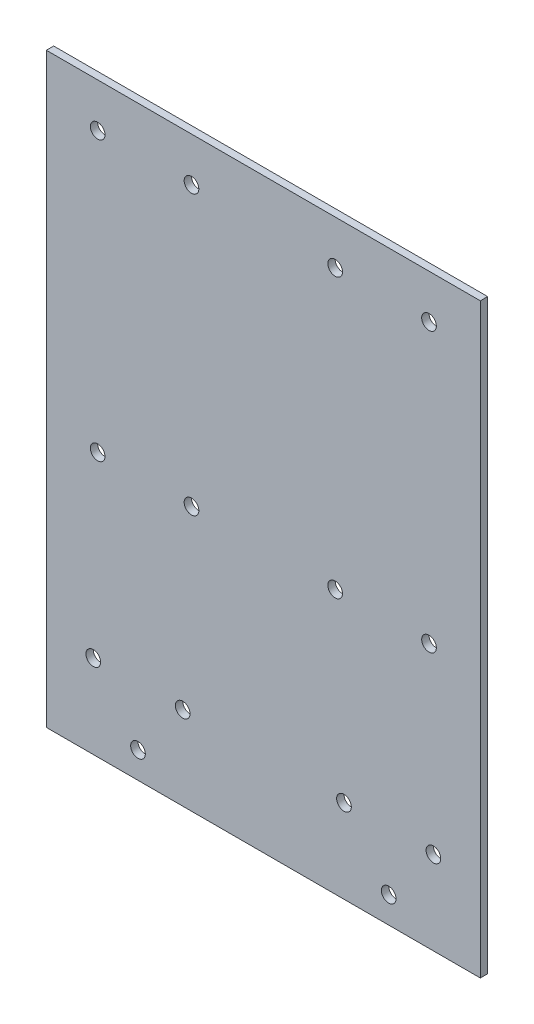
ISO-10303-21;
HEADER;
FILE_DESCRIPTION(('STEP AP214'),'2;1');
FILE_NAME('part.step','',(''),(''),'','','');
FILE_SCHEMA(('AUTOMOTIVE_DESIGN { 1 0 10303 214 1 1 1 1 }'));
ENDSEC;
DATA;
#1=APPLICATION_CONTEXT('core data for automotive mechanical design processes');
#2=APPLICATION_PROTOCOL_DEFINITION('international standard','automotive_design',2000,#1);
#3=PRODUCT_CONTEXT('',#1,'mechanical');
#4=PRODUCT('Part','Part','',(#3));
#5=PRODUCT_RELATED_PRODUCT_CATEGORY('part','',(#4));
#6=PRODUCT_DEFINITION_FORMATION('','',#4);
#7=PRODUCT_DEFINITION_CONTEXT('part definition',#1,'design');
#8=PRODUCT_DEFINITION('design','',#6,#7);
#9=PRODUCT_DEFINITION_SHAPE('','',#8);
#10=(LENGTH_UNIT() NAMED_UNIT(*) SI_UNIT(.MILLI.,.METRE.));
#11=(NAMED_UNIT(*) PLANE_ANGLE_UNIT() SI_UNIT($,.RADIAN.));
#12=(NAMED_UNIT(*) SI_UNIT($,.STERADIAN.) SOLID_ANGLE_UNIT());
#13=UNCERTAINTY_MEASURE_WITH_UNIT(LENGTH_MEASURE(1.E-05),#10,'distance_accuracy_value','');
#14=(GEOMETRIC_REPRESENTATION_CONTEXT(3) GLOBAL_UNCERTAINTY_ASSIGNED_CONTEXT((#13)) GLOBAL_UNIT_ASSIGNED_CONTEXT((#10,
#11,#12)) REPRESENTATION_CONTEXT('',''));
#15=CARTESIAN_POINT('',(0.,0.,0.));
#16=DIRECTION('',(0.,0.,1.));
#17=DIRECTION('',(1.,0.,0.));
#18=AXIS2_PLACEMENT_3D('',#15,#16,#17);
#19=CARTESIAN_POINT('',(0.,0.,2.5));
#20=DIRECTION('',(0.,0.,1.));
#21=DIRECTION('',(1.,0.,0.));
#22=AXIS2_PLACEMENT_3D('',#19,#20,#21);
#23=PLANE('',#22);
#24=CARTESIAN_POINT('',(24.4999999999997,85.,2.5));
#25=DIRECTION('',(0.,0.,1.));
#26=DIRECTION('',(-1.,0.,0.));
#27=AXIS2_PLACEMENT_3D('',#24,#25,#26);
#28=CIRCLE('',#27,2.5);
#29=CARTESIAN_POINT('',(21.9999999999997,85.,2.5));
#30=VERTEX_POINT('',#29);
#31=EDGE_CURVE('E395',#30,#30,#28,.T.);
#32=ORIENTED_EDGE('',*,*,#31,.F.);
#33=EDGE_LOOP('',(#32));
#34=FACE_BOUND('',#33,.T.);
#35=CARTESIAN_POINT('',(-24.5000000000003,85.,2.5));
#36=DIRECTION('',(0.,0.,1.));
#37=DIRECTION('',(1.,0.,0.));
#38=AXIS2_PLACEMENT_3D('',#35,#36,#37);
#39=CIRCLE('',#38,2.5);
#40=CARTESIAN_POINT('',(-22.0000000000003,85.,2.5));
#41=VERTEX_POINT('',#40);
#42=EDGE_CURVE('E396',#41,#41,#39,.T.);
#43=ORIENTED_EDGE('',*,*,#42,.F.);
#44=EDGE_LOOP('',(#43));
#45=FACE_BOUND('',#44,.T.);
#46=CARTESIAN_POINT('',(-56.5000000000003,85.,2.5));
#47=DIRECTION('',(0.,0.,1.));
#48=DIRECTION('',(1.,0.,0.));
#49=AXIS2_PLACEMENT_3D('',#46,#47,#48);
#50=CIRCLE('',#49,2.50000000000001);
#51=CARTESIAN_POINT('',(-54.0000000000003,85.,2.5));
#52=VERTEX_POINT('',#51);
#53=EDGE_CURVE('E400',#52,#52,#50,.T.);
#54=ORIENTED_EDGE('',*,*,#53,.F.);
#55=EDGE_LOOP('',(#54));
#56=FACE_BOUND('',#55,.T.);
#57=CARTESIAN_POINT('',(-24.5,-9.99999999999998,2.5));
#58=DIRECTION('',(0.,0.,1.));
#59=DIRECTION('',(1.,0.,0.));
#60=AXIS2_PLACEMENT_3D('',#57,#58,#59);
#61=CIRCLE('',#60,2.5);
#62=CARTESIAN_POINT('',(-22.,-9.99999999999998,2.5));
#63=VERTEX_POINT('',#62);
#64=EDGE_CURVE('E407',#63,#63,#61,.T.);
#65=ORIENTED_EDGE('',*,*,#64,.F.);
#66=EDGE_LOOP('',(#65));
#67=FACE_BOUND('',#66,.T.);
#68=CARTESIAN_POINT('',(56.4999999999994,-9.99999999999997,2.5));
#69=DIRECTION('',(0.,0.,1.));
#70=DIRECTION('',(-1.,0.,0.));
#71=AXIS2_PLACEMENT_3D('',#68,#69,#70);
#72=CIRCLE('',#71,2.49999999999999);
#73=CARTESIAN_POINT('',(53.9999999999994,-9.99999999999997,2.5));
#74=VERTEX_POINT('',#73);
#75=EDGE_CURVE('E426',#74,#74,#72,.T.);
#76=ORIENTED_EDGE('',*,*,#75,.F.);
#77=EDGE_LOOP('',(#76));
#78=FACE_BOUND('',#77,.T.);
#79=CARTESIAN_POINT('',(24.4999999999993,-9.99999999999997,2.5));
#80=DIRECTION('',(0.,0.,1.));
#81=DIRECTION('',(-1.,0.,0.));
#82=AXIS2_PLACEMENT_3D('',#79,#80,#81);
#83=CIRCLE('',#82,2.5);
#84=CARTESIAN_POINT('',(21.9999999999993,-9.99999999999997,2.5));
#85=VERTEX_POINT('',#84);
#86=EDGE_CURVE('E403',#85,#85,#83,.T.);
#87=ORIENTED_EDGE('',*,*,#86,.F.);
#88=EDGE_LOOP('',(#87));
#89=FACE_BOUND('',#88,.T.);
#90=CARTESIAN_POINT('',(56.4999999999997,85.,2.5));
#91=DIRECTION('',(0.,0.,1.));
#92=DIRECTION('',(-1.,0.,0.));
#93=AXIS2_PLACEMENT_3D('',#90,#91,#92);
#94=CIRCLE('',#93,2.50000000000001);
#95=CARTESIAN_POINT('',(53.9999999999996,85.,2.5));
#96=VERTEX_POINT('',#95);
#97=EDGE_CURVE('E397',#96,#96,#94,.T.);
#98=ORIENTED_EDGE('',*,*,#97,.F.);
#99=EDGE_LOOP('',(#98));
#100=FACE_BOUND('',#99,.T.);
#101=CARTESIAN_POINT('',(-56.5,-9.99999999999998,2.5));
#102=DIRECTION('',(0.,0.,1.));
#103=DIRECTION('',(1.,0.,0.));
#104=AXIS2_PLACEMENT_3D('',#101,#102,#103);
#105=CIRCLE('',#104,2.49999999999999);
#106=CARTESIAN_POINT('',(-54.,-9.99999999999998,2.5));
#107=VERTEX_POINT('',#106);
#108=EDGE_CURVE('E117',#107,#107,#105,.T.);
#109=ORIENTED_EDGE('',*,*,#108,.F.);
#110=EDGE_LOOP('',(#109));
#111=FACE_BOUND('',#110,.T.);
#112=CARTESIAN_POINT('',(58.,-71.5,2.5));
#113=DIRECTION('',(0.,0.,1.));
#114=DIRECTION('',(-1.,0.,0.));
#115=AXIS2_PLACEMENT_3D('',#112,#113,#114);
#116=CIRCLE('',#115,2.50000000000001);
#117=CARTESIAN_POINT('',(55.5,-71.5,2.5));
#118=VERTEX_POINT('',#117);
#119=EDGE_CURVE('E149',#118,#118,#116,.T.);
#120=ORIENTED_EDGE('',*,*,#119,.F.);
#121=EDGE_LOOP('',(#120));
#122=FACE_BOUND('',#121,.T.);
#123=CARTESIAN_POINT('',(-42.75,-91.,2.5));
#124=DIRECTION('',(0.,0.,1.));
#125=DIRECTION('',(1.,0.,0.));
#126=AXIS2_PLACEMENT_3D('',#123,#124,#125);
#127=CIRCLE('',#126,2.5);
#128=CARTESIAN_POINT('',(-40.25,-91.,2.5));
#129=VERTEX_POINT('',#128);
#130=EDGE_CURVE('E161',#129,#129,#127,.T.);
#131=ORIENTED_EDGE('',*,*,#130,.F.);
#132=EDGE_LOOP('',(#131));
#133=FACE_BOUND('',#132,.T.);
#134=CARTESIAN_POINT('',(-58.,-71.5,2.5));
#135=DIRECTION('',(0.,0.,1.));
#136=DIRECTION('',(1.,0.,0.));
#137=AXIS2_PLACEMENT_3D('',#134,#135,#136);
#138=CIRCLE('',#137,2.50000000000001);
#139=CARTESIAN_POINT('',(-55.5,-71.5,2.5));
#140=VERTEX_POINT('',#139);
#141=EDGE_CURVE('E107',#140,#140,#138,.T.);
#142=ORIENTED_EDGE('',*,*,#141,.F.);
#143=EDGE_LOOP('',(#142));
#144=FACE_BOUND('',#143,.T.);
#145=DIRECTION('',(0.,-1.,0.));
#146=VECTOR('',#145,1.);
#147=CARTESIAN_POINT('',(-74.,-100.,2.5));
#148=LINE('',#147,#146);
#149=CARTESIAN_POINT('',(-74.,100.,2.5));
#150=VERTEX_POINT('',#149);
#151=CARTESIAN_POINT('',(-74.,-100.,2.5));
#152=VERTEX_POINT('',#151);
#153=EDGE_CURVE('E91',#150,#152,#148,.T.);
#154=ORIENTED_EDGE('',*,*,#153,.T.);
#155=DIRECTION('',(1.,0.,0.));
#156=VECTOR('',#155,1.);
#157=CARTESIAN_POINT('',(74.,-100.,2.5));
#158=LINE('',#157,#156);
#159=CARTESIAN_POINT('',(74.,-100.,2.5));
#160=VERTEX_POINT('',#159);
#161=EDGE_CURVE('E86',#152,#160,#158,.T.);
#162=ORIENTED_EDGE('',*,*,#161,.T.);
#163=DIRECTION('',(0.,1.,0.));
#164=VECTOR('',#163,1.);
#165=CARTESIAN_POINT('',(74.,-100.,2.5));
#166=LINE('',#165,#164);
#167=CARTESIAN_POINT('',(74.,100.,2.5));
#168=VERTEX_POINT('',#167);
#169=EDGE_CURVE('E89',#160,#168,#166,.T.);
#170=ORIENTED_EDGE('',*,*,#169,.T.);
#171=DIRECTION('',(-1.,0.,0.));
#172=VECTOR('',#171,1.);
#173=CARTESIAN_POINT('',(74.,100.,2.5));
#174=LINE('',#173,#172);
#175=EDGE_CURVE('E56',#168,#150,#174,.T.);
#176=ORIENTED_EDGE('',*,*,#175,.T.);
#177=EDGE_LOOP('',(#154,#162,#170,#176));
#178=FACE_BOUND('',#177,.T.);
#179=CARTESIAN_POINT('',(-27.5,-71.5,2.5));
#180=DIRECTION('',(0.,0.,1.));
#181=DIRECTION('',(1.,0.,0.));
#182=AXIS2_PLACEMENT_3D('',#179,#180,#181);
#183=CIRCLE('',#182,2.5);
#184=CARTESIAN_POINT('',(-25.,-71.5,2.5));
#185=VERTEX_POINT('',#184);
#186=EDGE_CURVE('E167',#185,#185,#183,.T.);
#187=ORIENTED_EDGE('',*,*,#186,.F.);
#188=EDGE_LOOP('',(#187));
#189=FACE_BOUND('',#188,.T.);
#190=CARTESIAN_POINT('',(42.75,-91.,2.5));
#191=DIRECTION('',(0.,0.,1.));
#192=DIRECTION('',(-1.,0.,0.));
#193=AXIS2_PLACEMENT_3D('',#190,#191,#192);
#194=CIRCLE('',#193,2.5);
#195=CARTESIAN_POINT('',(40.25,-91.,2.5));
#196=VERTEX_POINT('',#195);
#197=EDGE_CURVE('E155',#196,#196,#194,.T.);
#198=ORIENTED_EDGE('',*,*,#197,.F.);
#199=EDGE_LOOP('',(#198));
#200=FACE_BOUND('',#199,.T.);
#201=CARTESIAN_POINT('',(27.5,-71.5,2.5));
#202=DIRECTION('',(0.,0.,1.));
#203=DIRECTION('',(-1.,0.,0.));
#204=AXIS2_PLACEMENT_3D('',#201,#202,#203);
#205=CIRCLE('',#204,2.5);
#206=CARTESIAN_POINT('',(25.,-71.5,2.5));
#207=VERTEX_POINT('',#206);
#208=EDGE_CURVE('E140',#207,#207,#205,.T.);
#209=ORIENTED_EDGE('',*,*,#208,.F.);
#210=EDGE_LOOP('',(#209));
#211=FACE_BOUND('',#210,.T.);
#212=ADVANCED_FACE('F37',(#34,#45,#56,#67,#78,#89,#100,#111,#122,#133,#144,#178,#189,#200,#211),
#23,.T.);
#213=CARTESIAN_POINT('',(0.,0.,0.));
#214=DIRECTION('',(0.,0.,1.));
#215=DIRECTION('',(1.,0.,0.));
#216=AXIS2_PLACEMENT_3D('',#213,#214,#215);
#217=PLANE('',#216);
#218=CARTESIAN_POINT('',(24.4999999999997,85.,0.));
#219=DIRECTION('',(0.,0.,1.));
#220=DIRECTION('',(1.,0.,0.));
#221=AXIS2_PLACEMENT_3D('',#218,#219,#220);
#222=CIRCLE('',#221,2.5);
#223=CARTESIAN_POINT('',(26.9999999999997,85.,0.));
#224=VERTEX_POINT('',#223);
#225=EDGE_CURVE('E41',#224,#224,#222,.T.);
#226=ORIENTED_EDGE('',*,*,#225,.T.);
#227=EDGE_LOOP('',(#226));
#228=FACE_BOUND('',#227,.T.);
#229=CARTESIAN_POINT('',(-24.5000000000003,85.,0.));
#230=DIRECTION('',(0.,0.,1.));
#231=DIRECTION('',(1.,0.,0.));
#232=AXIS2_PLACEMENT_3D('',#229,#230,#231);
#233=CIRCLE('',#232,2.5);
#234=CARTESIAN_POINT('',(-22.0000000000003,85.,0.));
#235=VERTEX_POINT('',#234);
#236=EDGE_CURVE('E131',#235,#235,#233,.T.);
#237=ORIENTED_EDGE('',*,*,#236,.T.);
#238=EDGE_LOOP('',(#237));
#239=FACE_BOUND('',#238,.T.);
#240=CARTESIAN_POINT('',(-56.5000000000003,85.,0.));
#241=DIRECTION('',(0.,0.,1.));
#242=DIRECTION('',(1.,0.,0.));
#243=AXIS2_PLACEMENT_3D('',#240,#241,#242);
#244=CIRCLE('',#243,2.50000000000001);
#245=CARTESIAN_POINT('',(-54.0000000000003,85.,0.));
#246=VERTEX_POINT('',#245);
#247=EDGE_CURVE('E129',#246,#246,#244,.T.);
#248=ORIENTED_EDGE('',*,*,#247,.T.);
#249=EDGE_LOOP('',(#248));
#250=FACE_BOUND('',#249,.T.);
#251=CARTESIAN_POINT('',(-24.5,-9.99999999999998,0.));
#252=DIRECTION('',(0.,0.,1.));
#253=DIRECTION('',(1.,0.,0.));
#254=AXIS2_PLACEMENT_3D('',#251,#252,#253);
#255=CIRCLE('',#254,2.5);
#256=CARTESIAN_POINT('',(-22.,-9.99999999999998,0.));
#257=VERTEX_POINT('',#256);
#258=EDGE_CURVE('E126',#257,#257,#255,.T.);
#259=ORIENTED_EDGE('',*,*,#258,.T.);
#260=EDGE_LOOP('',(#259));
#261=FACE_BOUND('',#260,.T.);
#262=CARTESIAN_POINT('',(56.4999999999994,-9.99999999999997,0.));
#263=DIRECTION('',(0.,0.,1.));
#264=DIRECTION('',(1.,0.,0.));
#265=AXIS2_PLACEMENT_3D('',#262,#263,#264);
#266=CIRCLE('',#265,2.49999999999999);
#267=CARTESIAN_POINT('',(58.9999999999994,-9.99999999999997,0.));
#268=VERTEX_POINT('',#267);
#269=EDGE_CURVE('E123',#268,#268,#266,.T.);
#270=ORIENTED_EDGE('',*,*,#269,.T.);
#271=EDGE_LOOP('',(#270));
#272=FACE_BOUND('',#271,.T.);
#273=CARTESIAN_POINT('',(24.4999999999993,-9.99999999999997,0.));
#274=DIRECTION('',(0.,0.,1.));
#275=DIRECTION('',(1.,0.,0.));
#276=AXIS2_PLACEMENT_3D('',#273,#274,#275);
#277=CIRCLE('',#276,2.5);
#278=CARTESIAN_POINT('',(26.9999999999993,-9.99999999999997,0.));
#279=VERTEX_POINT('',#278);
#280=EDGE_CURVE('E120',#279,#279,#277,.T.);
#281=ORIENTED_EDGE('',*,*,#280,.T.);
#282=EDGE_LOOP('',(#281));
#283=FACE_BOUND('',#282,.T.);
#284=CARTESIAN_POINT('',(56.4999999999997,85.,0.));
#285=DIRECTION('',(0.,0.,1.));
#286=DIRECTION('',(1.,0.,0.));
#287=AXIS2_PLACEMENT_3D('',#284,#285,#286);
#288=CIRCLE('',#287,2.50000000000001);
#289=CARTESIAN_POINT('',(58.9999999999997,85.,0.));
#290=VERTEX_POINT('',#289);
#291=EDGE_CURVE('E116',#290,#290,#288,.T.);
#292=ORIENTED_EDGE('',*,*,#291,.T.);
#293=EDGE_LOOP('',(#292));
#294=FACE_BOUND('',#293,.T.);
#295=CARTESIAN_POINT('',(-56.5,-9.99999999999998,0.));
#296=DIRECTION('',(0.,0.,1.));
#297=DIRECTION('',(1.,0.,0.));
#298=AXIS2_PLACEMENT_3D('',#295,#296,#297);
#299=CIRCLE('',#298,2.49999999999999);
#300=CARTESIAN_POINT('',(-54.,-9.99999999999998,0.));
#301=VERTEX_POINT('',#300);
#302=EDGE_CURVE('E113',#301,#301,#299,.T.);
#303=ORIENTED_EDGE('',*,*,#302,.T.);
#304=EDGE_LOOP('',(#303));
#305=FACE_BOUND('',#304,.T.);
#306=DIRECTION('',(0.,-1.,0.));
#307=VECTOR('',#306,1.);
#308=CARTESIAN_POINT('',(-74.,-100.,0.));
#309=LINE('',#308,#307);
#310=CARTESIAN_POINT('',(-74.,100.,0.));
#311=VERTEX_POINT('',#310);
#312=CARTESIAN_POINT('',(-74.,-100.,0.));
#313=VERTEX_POINT('',#312);
#314=EDGE_CURVE('E104',#311,#313,#309,.T.);
#315=ORIENTED_EDGE('',*,*,#314,.F.);
#316=DIRECTION('',(-1.,0.,0.));
#317=VECTOR('',#316,1.);
#318=CARTESIAN_POINT('',(74.,100.,0.));
#319=LINE('',#318,#317);
#320=CARTESIAN_POINT('',(74.,100.,0.));
#321=VERTEX_POINT('',#320);
#322=EDGE_CURVE('E79',#321,#311,#319,.T.);
#323=ORIENTED_EDGE('',*,*,#322,.F.);
#324=DIRECTION('',(0.,1.,0.));
#325=VECTOR('',#324,1.);
#326=CARTESIAN_POINT('',(74.,-100.,0.));
#327=LINE('',#326,#325);
#328=CARTESIAN_POINT('',(74.,-100.,0.));
#329=VERTEX_POINT('',#328);
#330=EDGE_CURVE('E73',#329,#321,#327,.T.);
#331=ORIENTED_EDGE('',*,*,#330,.F.);
#332=DIRECTION('',(1.,0.,0.));
#333=VECTOR('',#332,1.);
#334=CARTESIAN_POINT('',(74.,-100.,0.));
#335=LINE('',#334,#333);
#336=EDGE_CURVE('E95',#313,#329,#335,.T.);
#337=ORIENTED_EDGE('',*,*,#336,.F.);
#338=EDGE_LOOP('',(#315,#323,#331,#337));
#339=FACE_BOUND('',#338,.T.);
#340=CARTESIAN_POINT('',(-58.,-71.5,0.));
#341=DIRECTION('',(0.,0.,1.));
#342=DIRECTION('',(1.,0.,0.));
#343=AXIS2_PLACEMENT_3D('',#340,#341,#342);
#344=CIRCLE('',#343,2.50000000000001);
#345=CARTESIAN_POINT('',(-55.5,-71.5,0.));
#346=VERTEX_POINT('',#345);
#347=EDGE_CURVE('E170',#346,#346,#344,.T.);
#348=ORIENTED_EDGE('',*,*,#347,.T.);
#349=EDGE_LOOP('',(#348));
#350=FACE_BOUND('',#349,.T.);
#351=CARTESIAN_POINT('',(-27.5,-71.5,0.));
#352=DIRECTION('',(0.,0.,1.));
#353=DIRECTION('',(1.,0.,0.));
#354=AXIS2_PLACEMENT_3D('',#351,#352,#353);
#355=CIRCLE('',#354,2.5);
#356=CARTESIAN_POINT('',(-25.,-71.5,0.));
#357=VERTEX_POINT('',#356);
#358=EDGE_CURVE('E164',#357,#357,#355,.T.);
#359=ORIENTED_EDGE('',*,*,#358,.T.);
#360=EDGE_LOOP('',(#359));
#361=FACE_BOUND('',#360,.T.);
#362=CARTESIAN_POINT('',(-42.75,-91.,0.));
#363=DIRECTION('',(0.,0.,1.));
#364=DIRECTION('',(1.,0.,0.));
#365=AXIS2_PLACEMENT_3D('',#362,#363,#364);
#366=CIRCLE('',#365,2.5);
#367=CARTESIAN_POINT('',(-40.25,-91.,0.));
#368=VERTEX_POINT('',#367);
#369=EDGE_CURVE('E158',#368,#368,#366,.T.);
#370=ORIENTED_EDGE('',*,*,#369,.T.);
#371=EDGE_LOOP('',(#370));
#372=FACE_BOUND('',#371,.T.);
#373=CARTESIAN_POINT('',(42.75,-91.,0.));
#374=DIRECTION('',(0.,0.,1.));
#375=DIRECTION('',(-1.,0.,0.));
#376=AXIS2_PLACEMENT_3D('',#373,#374,#375);
#377=CIRCLE('',#376,2.5);
#378=CARTESIAN_POINT('',(40.25,-91.,0.));
#379=VERTEX_POINT('',#378);
#380=EDGE_CURVE('E152',#379,#379,#377,.T.);
#381=ORIENTED_EDGE('',*,*,#380,.T.);
#382=EDGE_LOOP('',(#381));
#383=FACE_BOUND('',#382,.T.);
#384=CARTESIAN_POINT('',(58.,-71.5,0.));
#385=DIRECTION('',(0.,0.,1.));
#386=DIRECTION('',(-1.,0.,0.));
#387=AXIS2_PLACEMENT_3D('',#384,#385,#386);
#388=CIRCLE('',#387,2.50000000000001);
#389=CARTESIAN_POINT('',(55.5,-71.5,0.));
#390=VERTEX_POINT('',#389);
#391=EDGE_CURVE('E145',#390,#390,#388,.T.);
#392=ORIENTED_EDGE('',*,*,#391,.T.);
#393=EDGE_LOOP('',(#392));
#394=FACE_BOUND('',#393,.T.);
#395=CARTESIAN_POINT('',(27.5,-71.5,0.));
#396=DIRECTION('',(0.,0.,1.));
#397=DIRECTION('',(-1.,0.,0.));
#398=AXIS2_PLACEMENT_3D('',#395,#396,#397);
#399=CIRCLE('',#398,2.5);
#400=CARTESIAN_POINT('',(25.,-71.5,0.));
#401=VERTEX_POINT('',#400);
#402=EDGE_CURVE('E136',#401,#401,#399,.T.);
#403=ORIENTED_EDGE('',*,*,#402,.T.);
#404=EDGE_LOOP('',(#403));
#405=FACE_BOUND('',#404,.T.);
#406=ADVANCED_FACE('F178',(#228,#239,#250,#261,#272,#283,#294,#305,#339,#350,#361,#372,#383,
#394,#405),#217,.F.);
#407=CARTESIAN_POINT('',(-74.,-100.,2.5));
#408=DIRECTION('',(1.,0.,0.));
#409=DIRECTION('',(0.,1.,0.));
#410=AXIS2_PLACEMENT_3D('',#407,#408,#409);
#411=PLANE('',#410);
#412=ORIENTED_EDGE('',*,*,#314,.T.);
#413=DIRECTION('',(0.,0.,-1.));
#414=VECTOR('',#413,1.);
#415=CARTESIAN_POINT('',(-74.,-100.,2.5));
#416=LINE('',#415,#414);
#417=EDGE_CURVE('E11',#152,#313,#416,.T.);
#418=ORIENTED_EDGE('',*,*,#417,.F.);
#419=ORIENTED_EDGE('',*,*,#153,.F.);
#420=DIRECTION('',(0.,0.,-1.));
#421=VECTOR('',#420,1.);
#422=CARTESIAN_POINT('',(-74.,100.,2.5));
#423=LINE('',#422,#421);
#424=EDGE_CURVE('E100',#150,#311,#423,.T.);
#425=ORIENTED_EDGE('',*,*,#424,.T.);
#426=EDGE_LOOP('',(#412,#418,#419,#425));
#427=FACE_BOUND('',#426,.T.);
#428=ADVANCED_FACE('F39',(#427),#411,.F.);
#429=CARTESIAN_POINT('',(74.,-100.,2.5));
#430=DIRECTION('',(0.,1.,0.));
#431=DIRECTION('',(0.,0.,1.));
#432=AXIS2_PLACEMENT_3D('',#429,#430,#431);
#433=PLANE('',#432);
#434=ORIENTED_EDGE('',*,*,#336,.T.);
#435=DIRECTION('',(0.,0.,-1.));
#436=VECTOR('',#435,1.);
#437=CARTESIAN_POINT('',(74.,-100.,2.5));
#438=LINE('',#437,#436);
#439=EDGE_CURVE('E47',#160,#329,#438,.T.);
#440=ORIENTED_EDGE('',*,*,#439,.F.);
#441=ORIENTED_EDGE('',*,*,#161,.F.);
#442=ORIENTED_EDGE('',*,*,#417,.T.);
#443=EDGE_LOOP('',(#434,#440,#441,#442));
#444=FACE_BOUND('',#443,.T.);
#445=ADVANCED_FACE('F94',(#444),#433,.F.);
#446=CARTESIAN_POINT('',(74.,-100.,2.5));
#447=DIRECTION('',(-1.,0.,0.));
#448=DIRECTION('',(0.,-1.,0.));
#449=AXIS2_PLACEMENT_3D('',#446,#447,#448);
#450=PLANE('',#449);
#451=ORIENTED_EDGE('',*,*,#330,.T.);
#452=DIRECTION('',(0.,0.,-1.));
#453=VECTOR('',#452,1.);
#454=CARTESIAN_POINT('',(74.,100.,2.5));
#455=LINE('',#454,#453);
#456=EDGE_CURVE('E96',#168,#321,#455,.T.);
#457=ORIENTED_EDGE('',*,*,#456,.F.);
#458=ORIENTED_EDGE('',*,*,#169,.F.);
#459=ORIENTED_EDGE('',*,*,#439,.T.);
#460=EDGE_LOOP('',(#451,#457,#458,#459));
#461=FACE_BOUND('',#460,.T.);
#462=ADVANCED_FACE('F98',(#461),#450,.F.);
#463=CARTESIAN_POINT('',(74.,100.,2.5));
#464=DIRECTION('',(0.,-1.,0.));
#465=DIRECTION('',(0.,0.,-1.));
#466=AXIS2_PLACEMENT_3D('',#463,#464,#465);
#467=PLANE('',#466);
#468=ORIENTED_EDGE('',*,*,#322,.T.);
#469=ORIENTED_EDGE('',*,*,#424,.F.);
#470=ORIENTED_EDGE('',*,*,#175,.F.);
#471=ORIENTED_EDGE('',*,*,#456,.T.);
#472=EDGE_LOOP('',(#468,#469,#470,#471));
#473=FACE_BOUND('',#472,.T.);
#474=ADVANCED_FACE('F184',(#473),#467,.F.);
#475=CARTESIAN_POINT('',(-58.,-71.5,2.5));
#476=DIRECTION('',(0.,0.,-1.));
#477=DIRECTION('',(-1.,0.,0.));
#478=AXIS2_PLACEMENT_3D('',#475,#476,#477);
#479=CYLINDRICAL_SURFACE('',#478,2.50000000000001);
#480=ORIENTED_EDGE('',*,*,#141,.T.);
#481=EDGE_LOOP('',(#480));
#482=FACE_BOUND('',#481,.T.);
#483=ORIENTED_EDGE('',*,*,#347,.F.);
#484=EDGE_LOOP('',(#483));
#485=FACE_BOUND('',#484,.T.);
#486=ADVANCED_FACE('F181',(#482,#485),#479,.F.);
#487=CARTESIAN_POINT('',(-27.5,-71.5,2.5));
#488=DIRECTION('',(0.,0.,-1.));
#489=DIRECTION('',(-1.,0.,0.));
#490=AXIS2_PLACEMENT_3D('',#487,#488,#489);
#491=CYLINDRICAL_SURFACE('',#490,2.5);
#492=ORIENTED_EDGE('',*,*,#186,.T.);
#493=EDGE_LOOP('',(#492));
#494=FACE_BOUND('',#493,.T.);
#495=ORIENTED_EDGE('',*,*,#358,.F.);
#496=EDGE_LOOP('',(#495));
#497=FACE_BOUND('',#496,.T.);
#498=ADVANCED_FACE('F183',(#494,#497),#491,.F.);
#499=CARTESIAN_POINT('',(-42.75,-91.,2.5));
#500=DIRECTION('',(0.,0.,-1.));
#501=DIRECTION('',(-1.,0.,0.));
#502=AXIS2_PLACEMENT_3D('',#499,#500,#501);
#503=CYLINDRICAL_SURFACE('',#502,2.5);
#504=ORIENTED_EDGE('',*,*,#130,.T.);
#505=EDGE_LOOP('',(#504));
#506=FACE_BOUND('',#505,.T.);
#507=ORIENTED_EDGE('',*,*,#369,.F.);
#508=EDGE_LOOP('',(#507));
#509=FACE_BOUND('',#508,.T.);
#510=ADVANCED_FACE('F191',(#506,#509),#503,.F.);
#511=CARTESIAN_POINT('',(42.75,-91.,2.5));
#512=DIRECTION('',(0.,0.,-1.));
#513=DIRECTION('',(-1.,0.,0.));
#514=AXIS2_PLACEMENT_3D('',#511,#512,#513);
#515=CYLINDRICAL_SURFACE('',#514,2.5);
#516=ORIENTED_EDGE('',*,*,#197,.T.);
#517=EDGE_LOOP('',(#516));
#518=FACE_BOUND('',#517,.T.);
#519=ORIENTED_EDGE('',*,*,#380,.F.);
#520=EDGE_LOOP('',(#519));
#521=FACE_BOUND('',#520,.T.);
#522=ADVANCED_FACE('F318',(#518,#521),#515,.F.);
#523=CARTESIAN_POINT('',(58.,-71.5,2.5));
#524=DIRECTION('',(0.,0.,-1.));
#525=DIRECTION('',(-1.,0.,0.));
#526=AXIS2_PLACEMENT_3D('',#523,#524,#525);
#527=CYLINDRICAL_SURFACE('',#526,2.50000000000001);
#528=ORIENTED_EDGE('',*,*,#119,.T.);
#529=EDGE_LOOP('',(#528));
#530=FACE_BOUND('',#529,.T.);
#531=ORIENTED_EDGE('',*,*,#391,.F.);
#532=EDGE_LOOP('',(#531));
#533=FACE_BOUND('',#532,.T.);
#534=ADVANCED_FACE('F314',(#530,#533),#527,.F.);
#535=CARTESIAN_POINT('',(27.5,-71.5,2.5));
#536=DIRECTION('',(0.,0.,-1.));
#537=DIRECTION('',(-1.,0.,0.));
#538=AXIS2_PLACEMENT_3D('',#535,#536,#537);
#539=CYLINDRICAL_SURFACE('',#538,2.5);
#540=ORIENTED_EDGE('',*,*,#208,.T.);
#541=EDGE_LOOP('',(#540));
#542=FACE_BOUND('',#541,.T.);
#543=ORIENTED_EDGE('',*,*,#402,.F.);
#544=EDGE_LOOP('',(#543));
#545=FACE_BOUND('',#544,.T.);
#546=ADVANCED_FACE('F234',(#542,#545),#539,.F.);
#547=CARTESIAN_POINT('',(-56.5,-9.99999999999998,-0.5));
#548=DIRECTION('',(0.,0.,1.));
#549=DIRECTION('',(1.,0.,0.));
#550=AXIS2_PLACEMENT_3D('',#547,#548,#549);
#551=CYLINDRICAL_SURFACE('',#550,2.49999999999999);
#552=ORIENTED_EDGE('',*,*,#108,.T.);
#553=EDGE_LOOP('',(#552));
#554=FACE_BOUND('',#553,.T.);
#555=ORIENTED_EDGE('',*,*,#302,.F.);
#556=EDGE_LOOP('',(#555));
#557=FACE_BOUND('',#556,.T.);
#558=ADVANCED_FACE('F228',(#554,#557),#551,.F.);
#559=CARTESIAN_POINT('',(56.4999999999997,85.,-0.5));
#560=DIRECTION('',(0.,0.,1.));
#561=DIRECTION('',(1.,0.,0.));
#562=AXIS2_PLACEMENT_3D('',#559,#560,#561);
#563=CYLINDRICAL_SURFACE('',#562,2.50000000000001);
#564=ORIENTED_EDGE('',*,*,#97,.T.);
#565=EDGE_LOOP('',(#564));
#566=FACE_BOUND('',#565,.T.);
#567=ORIENTED_EDGE('',*,*,#291,.F.);
#568=EDGE_LOOP('',(#567));
#569=FACE_BOUND('',#568,.T.);
#570=ADVANCED_FACE('F233',(#566,#569),#563,.F.);
#571=CARTESIAN_POINT('',(24.4999999999993,-9.99999999999997,-0.5));
#572=DIRECTION('',(0.,0.,1.));
#573=DIRECTION('',(1.,0.,0.));
#574=AXIS2_PLACEMENT_3D('',#571,#572,#573);
#575=CYLINDRICAL_SURFACE('',#574,2.5);
#576=ORIENTED_EDGE('',*,*,#86,.T.);
#577=EDGE_LOOP('',(#576));
#578=FACE_BOUND('',#577,.T.);
#579=ORIENTED_EDGE('',*,*,#280,.F.);
#580=EDGE_LOOP('',(#579));
#581=FACE_BOUND('',#580,.T.);
#582=ADVANCED_FACE('F246',(#578,#581),#575,.F.);
#583=CARTESIAN_POINT('',(56.4999999999994,-9.99999999999997,-0.5));
#584=DIRECTION('',(0.,0.,1.));
#585=DIRECTION('',(1.,0.,0.));
#586=AXIS2_PLACEMENT_3D('',#583,#584,#585);
#587=CYLINDRICAL_SURFACE('',#586,2.49999999999999);
#588=ORIENTED_EDGE('',*,*,#75,.T.);
#589=EDGE_LOOP('',(#588));
#590=FACE_BOUND('',#589,.T.);
#591=ORIENTED_EDGE('',*,*,#269,.F.);
#592=EDGE_LOOP('',(#591));
#593=FACE_BOUND('',#592,.T.);
#594=ADVANCED_FACE('F256',(#590,#593),#587,.F.);
#595=CARTESIAN_POINT('',(-24.5,-9.99999999999998,-0.5));
#596=DIRECTION('',(0.,0.,1.));
#597=DIRECTION('',(1.,0.,0.));
#598=AXIS2_PLACEMENT_3D('',#595,#596,#597);
#599=CYLINDRICAL_SURFACE('',#598,2.5);
#600=ORIENTED_EDGE('',*,*,#64,.T.);
#601=EDGE_LOOP('',(#600));
#602=FACE_BOUND('',#601,.T.);
#603=ORIENTED_EDGE('',*,*,#258,.F.);
#604=EDGE_LOOP('',(#603));
#605=FACE_BOUND('',#604,.T.);
#606=ADVANCED_FACE('F266',(#602,#605),#599,.F.);
#607=CARTESIAN_POINT('',(-56.5000000000003,85.,-0.5));
#608=DIRECTION('',(0.,0.,1.));
#609=DIRECTION('',(1.,0.,0.));
#610=AXIS2_PLACEMENT_3D('',#607,#608,#609);
#611=CYLINDRICAL_SURFACE('',#610,2.50000000000001);
#612=ORIENTED_EDGE('',*,*,#53,.T.);
#613=EDGE_LOOP('',(#612));
#614=FACE_BOUND('',#613,.T.);
#615=ORIENTED_EDGE('',*,*,#247,.F.);
#616=EDGE_LOOP('',(#615));
#617=FACE_BOUND('',#616,.T.);
#618=ADVANCED_FACE('F276',(#614,#617),#611,.F.);
#619=CARTESIAN_POINT('',(-24.5000000000003,85.,-0.5));
#620=DIRECTION('',(0.,0.,1.));
#621=DIRECTION('',(1.,0.,0.));
#622=AXIS2_PLACEMENT_3D('',#619,#620,#621);
#623=CYLINDRICAL_SURFACE('',#622,2.5);
#624=ORIENTED_EDGE('',*,*,#42,.T.);
#625=EDGE_LOOP('',(#624));
#626=FACE_BOUND('',#625,.T.);
#627=ORIENTED_EDGE('',*,*,#236,.F.);
#628=EDGE_LOOP('',(#627));
#629=FACE_BOUND('',#628,.T.);
#630=ADVANCED_FACE('F286',(#626,#629),#623,.F.);
#631=CARTESIAN_POINT('',(24.4999999999997,85.,-0.5));
#632=DIRECTION('',(0.,0.,1.));
#633=DIRECTION('',(1.,0.,0.));
#634=AXIS2_PLACEMENT_3D('',#631,#632,#633);
#635=CYLINDRICAL_SURFACE('',#634,2.5);
#636=ORIENTED_EDGE('',*,*,#31,.T.);
#637=EDGE_LOOP('',(#636));
#638=FACE_BOUND('',#637,.T.);
#639=ORIENTED_EDGE('',*,*,#225,.F.);
#640=EDGE_LOOP('',(#639));
#641=FACE_BOUND('',#640,.T.);
#642=ADVANCED_FACE('F296',(#638,#641),#635,.F.);
#643=CLOSED_SHELL('',(#212,#406,#428,#445,#462,#474,#486,#498,#510,#522,#534,#546,#558,#570,
#582,#594,#606,#618,#630,#642));
#644=MANIFOLD_SOLID_BREP('B2',#643);
#645=ADVANCED_BREP_SHAPE_REPRESENTATION('',(#18,#644),#14);
#646=SHAPE_DEFINITION_REPRESENTATION(#9,#645);
ENDSEC;
END-ISO-10303-21;
